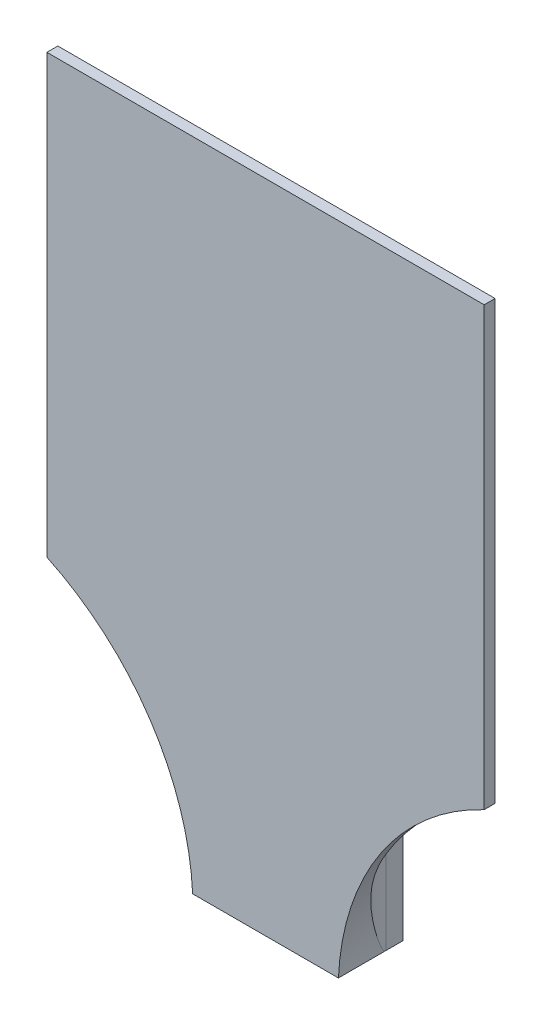
ISO-10303-21;
HEADER;
FILE_DESCRIPTION(('STEP AP214'),'2;1');
FILE_NAME('part.step','',(''),(''),'','','');
FILE_SCHEMA(('AUTOMOTIVE_DESIGN { 1 0 10303 214 1 1 1 1 }'));
ENDSEC;
DATA;
#1=APPLICATION_CONTEXT('core data for automotive mechanical design processes');
#2=APPLICATION_PROTOCOL_DEFINITION('international standard','automotive_design',2000,#1);
#3=PRODUCT_CONTEXT('',#1,'mechanical');
#4=PRODUCT('Part','Part','',(#3));
#5=PRODUCT_RELATED_PRODUCT_CATEGORY('part','',(#4));
#6=PRODUCT_DEFINITION_FORMATION('','',#4);
#7=PRODUCT_DEFINITION_CONTEXT('part definition',#1,'design');
#8=PRODUCT_DEFINITION('design','',#6,#7);
#9=PRODUCT_DEFINITION_SHAPE('','',#8);
#10=(LENGTH_UNIT() NAMED_UNIT(*) SI_UNIT(.MILLI.,.METRE.));
#11=(NAMED_UNIT(*) PLANE_ANGLE_UNIT() SI_UNIT($,.RADIAN.));
#12=(NAMED_UNIT(*) SI_UNIT($,.STERADIAN.) SOLID_ANGLE_UNIT());
#13=UNCERTAINTY_MEASURE_WITH_UNIT(LENGTH_MEASURE(1.E-05),#10,'distance_accuracy_value','');
#14=(GEOMETRIC_REPRESENTATION_CONTEXT(3) GLOBAL_UNCERTAINTY_ASSIGNED_CONTEXT((#13)) GLOBAL_UNIT_ASSIGNED_CONTEXT((#10,
#11,#12)) REPRESENTATION_CONTEXT('',''));
#15=CARTESIAN_POINT('',(0.,0.,0.));
#16=DIRECTION('',(0.,0.,1.));
#17=DIRECTION('',(1.,0.,0.));
#18=AXIS2_PLACEMENT_3D('',#15,#16,#17);
#19=CARTESIAN_POINT('',(-191.84651359388,180.,7.00000000000004));
#20=DIRECTION('',(0.,-0.099503719020999,0.995037190209989));
#21=DIRECTION('',(0.,-0.995037190209989,-0.099503719020999));
#22=AXIS2_PLACEMENT_3D('',#19,#20,#21);
#23=PLANE('',#22);
#24=DIRECTION('',(0.,-0.995037190209989,-0.099503719020999));
#25=VECTOR('',#24,1.);
#26=CARTESIAN_POINT('',(-17.,180.,7.00000000000001));
#27=LINE('',#26,#25);
#28=CARTESIAN_POINT('',(-17.,80.,-2.99999999999999));
#29=VERTEX_POINT('',#28);
#30=CARTESIAN_POINT('',(-17.,23.139494745971,-8.68605052540289));
#31=VERTEX_POINT('',#30);
#32=EDGE_CURVE('E197',#29,#31,#27,.T.);
#33=ORIENTED_EDGE('',*,*,#32,.T.);
#34=CARTESIAN_POINT('',(-7.50000000000049,359.999999999953,24.9999999999953));
#35=DIRECTION('',(0.,-0.099503719020999,0.995037190209989));
#36=DIRECTION('',(0.,-0.995037190209989,-0.099503719020999));
#37=AXIS2_PLACEMENT_3D('',#34,#35,#36);
#38=ELLIPSE('',#37,351.745646739184,34.9999999999953);
#39=CARTESIAN_POINT('',(-20.,33.0825792344509,-7.6917420765549));
#40=VERTEX_POINT('',#39);
#41=EDGE_CURVE('E416',#31,#40,#38,.F.);
#42=ORIENTED_EDGE('',*,*,#41,.T.);
#43=DIRECTION('',(0.,0.995037190209989,0.099503719020999));
#44=VECTOR('',#43,1.);
#45=CARTESIAN_POINT('',(-20.,180.,7.00000000000001));
#46=LINE('',#45,#44);
#47=CARTESIAN_POINT('',(-20.,80.,-2.99999999999999));
#48=VERTEX_POINT('',#47);
#49=EDGE_CURVE('E332',#40,#48,#46,.T.);
#50=ORIENTED_EDGE('',*,*,#49,.T.);
#51=CARTESIAN_POINT('',(-30.,80.,-2.99999999999999));
#52=DIRECTION('',(0.,-0.099503719020999,0.995037190209989));
#53=DIRECTION('',(0.,-0.995037190209989,-0.099503719020999));
#54=AXIS2_PLACEMENT_3D('',#51,#52,#53);
#55=ELLIPSE('',#54,100.498756211209,10.);
#56=CARTESIAN_POINT('',(-30.,180.,7.00000000000001));
#57=VERTEX_POINT('',#56);
#58=EDGE_CURVE('E269',#48,#57,#55,.T.);
#59=ORIENTED_EDGE('',*,*,#58,.T.);
#60=DIRECTION('',(1.,0.,0.));
#61=VECTOR('',#60,1.);
#62=CARTESIAN_POINT('',(-191.84651359388,180.,7.00000000000004));
#63=LINE('',#62,#61);
#64=CARTESIAN_POINT('',(-7.00000000000001,180.,7.00000000000001));
#65=VERTEX_POINT('',#64);
#66=EDGE_CURVE('E325',#57,#65,#63,.T.);
#67=ORIENTED_EDGE('',*,*,#66,.T.);
#68=CARTESIAN_POINT('',(-7.00000000000002,80.,-2.99999999999999));
#69=DIRECTION('',(0.,-0.099503719020999,0.995037190209989));
#70=DIRECTION('',(0.,-0.995037190209989,-0.099503719020999));
#71=AXIS2_PLACEMENT_3D('',#68,#69,#70);
#72=ELLIPSE('',#71,100.498756211209,10.);
#73=EDGE_CURVE('E449',#65,#29,#72,.T.);
#74=ORIENTED_EDGE('',*,*,#73,.T.);
#75=EDGE_LOOP('',(#33,#42,#50,#59,#67,#74));
#76=FACE_BOUND('',#75,.T.);
#77=ADVANCED_FACE('F33',(#76),#23,.F.);
#78=CARTESIAN_POINT('',(-20.,60.,-10.));
#79=DIRECTION('',(0.,0.,1.));
#80=DIRECTION('',(1.,0.,0.));
#81=AXIS2_PLACEMENT_3D('',#78,#79,#80);
#82=PLANE('',#81);
#83=DIRECTION('',(0.,-1.,0.));
#84=VECTOR('',#83,1.);
#85=CARTESIAN_POINT('',(7.49999999999951,180.,-10.));
#86=LINE('',#85,#84);
#87=CARTESIAN_POINT('',(7.49999999999951,10.,-10.));
#88=VERTEX_POINT('',#87);
#89=CARTESIAN_POINT('',(7.49999999999951,0.,-10.));
#90=VERTEX_POINT('',#89);
#91=EDGE_CURVE('E56',#88,#90,#86,.T.);
#92=ORIENTED_EDGE('',*,*,#91,.T.);
#93=DIRECTION('',(-1.,0.,0.));
#94=VECTOR('',#93,1.);
#95=CARTESIAN_POINT('',(-20.,0.,-10.));
#96=LINE('',#95,#94);
#97=CARTESIAN_POINT('',(-7.50000000000048,0.,-10.));
#98=VERTEX_POINT('',#97);
#99=EDGE_CURVE('E176',#90,#98,#96,.T.);
#100=ORIENTED_EDGE('',*,*,#99,.T.);
#101=DIRECTION('',(0.,-1.,0.));
#102=VECTOR('',#101,1.);
#103=CARTESIAN_POINT('',(-7.50000000000048,180.,-10.));
#104=LINE('',#103,#102);
#105=CARTESIAN_POINT('',(-7.50000000000048,10.0000000000001,-10.));
#106=VERTEX_POINT('',#105);
#107=EDGE_CURVE('E179',#106,#98,#104,.T.);
#108=ORIENTED_EDGE('',*,*,#107,.F.);
#109=DIRECTION('',(-1.,0.,0.));
#110=VECTOR('',#109,1.);
#111=CARTESIAN_POINT('',(17.,10.,-10.));
#112=LINE('',#111,#110);
#113=EDGE_CURVE('E178',#88,#106,#112,.T.);
#114=ORIENTED_EDGE('',*,*,#113,.F.);
#115=EDGE_LOOP('',(#92,#100,#108,#114));
#116=FACE_BOUND('',#115,.T.);
#117=ADVANCED_FACE('F174',(#116),#82,.F.);
#118=DIRECTION('',(0.,-0.995037190209989,-0.099503719020999));
#119=VECTOR('',#118,1.);
#120=CARTESIAN_POINT('',(20.,180.,7.00000000000001));
#121=LINE('',#120,#119);
#122=CARTESIAN_POINT('',(20.,80.,-2.99999999999999));
#123=VERTEX_POINT('',#122);
#124=CARTESIAN_POINT('',(20.,33.0825792344598,-7.69174207655402));
#125=VERTEX_POINT('',#124);
#126=EDGE_CURVE('E316',#123,#125,#121,.T.);
#127=ORIENTED_EDGE('',*,*,#126,.T.);
#128=CARTESIAN_POINT('',(7.49999999999951,360.000000000018,25.0000000000018));
#129=DIRECTION('',(0.,-0.099503719020999,0.995037190209989));
#130=DIRECTION('',(0.,-0.995037190209989,-0.099503719020999));
#131=AXIS2_PLACEMENT_3D('',#128,#129,#130);
#132=ELLIPSE('',#131,351.74564673924,35.0000000000009);
#133=CARTESIAN_POINT('',(17.,23.1394947459807,-8.68605052540193));
#134=VERTEX_POINT('',#133);
#135=EDGE_CURVE('E317',#125,#134,#132,.F.);
#136=ORIENTED_EDGE('',*,*,#135,.T.);
#137=DIRECTION('',(0.,0.995037190209989,0.099503719020999));
#138=VECTOR('',#137,1.);
#139=CARTESIAN_POINT('',(17.,180.,7.));
#140=LINE('',#139,#138);
#141=CARTESIAN_POINT('',(17.,80.,-2.99999999999999));
#142=VERTEX_POINT('',#141);
#143=EDGE_CURVE('E195',#134,#142,#140,.T.);
#144=ORIENTED_EDGE('',*,*,#143,.T.);
#145=CARTESIAN_POINT('',(6.99999999999999,80.,-2.99999999999999));
#146=DIRECTION('',(0.,-0.099503719020999,0.995037190209989));
#147=DIRECTION('',(0.,0.995037190209989,0.099503719020999));
#148=AXIS2_PLACEMENT_3D('',#145,#146,#147);
#149=ELLIPSE('',#148,100.498756211209,10.);
#150=CARTESIAN_POINT('',(7.,180.,7.00000000000001));
#151=VERTEX_POINT('',#150);
#152=EDGE_CURVE('E226',#142,#151,#149,.T.);
#153=ORIENTED_EDGE('',*,*,#152,.T.);
#154=CARTESIAN_POINT('',(30.,180.,7.00000000000001));
#155=VERTEX_POINT('',#154);
#156=EDGE_CURVE('E322',#151,#155,#63,.T.);
#157=ORIENTED_EDGE('',*,*,#156,.T.);
#158=CARTESIAN_POINT('',(30.,80.,-3.));
#159=DIRECTION('',(0.,-0.099503719020999,0.995037190209989));
#160=DIRECTION('',(0.,0.995037190209989,0.099503719020999));
#161=AXIS2_PLACEMENT_3D('',#158,#159,#160);
#162=ELLIPSE('',#161,100.498756211209,10.);
#163=EDGE_CURVE('E237',#155,#123,#162,.T.);
#164=ORIENTED_EDGE('',*,*,#163,.T.);
#165=EDGE_LOOP('',(#127,#136,#144,#153,#157,#164));
#166=FACE_BOUND('',#165,.T.);
#167=ADVANCED_FACE('F299',(#166),#23,.F.);
#168=CARTESIAN_POINT('',(10.,15.6568542494924,0.));
#169=DIRECTION('',(0.,-1.,0.));
#170=DIRECTION('',(0.,0.,-1.));
#171=AXIS2_PLACEMENT_3D('',#168,#169,#170);
#172=CYLINDRICAL_SURFACE('',#171,2.);
#173=CARTESIAN_POINT('',(10.,10.,0.));
#174=DIRECTION('',(0.,-1.,0.));
#175=DIRECTION('',(0.,0.,-1.));
#176=AXIS2_PLACEMENT_3D('',#173,#174,#175);
#177=CIRCLE('',#176,2.);
#178=CARTESIAN_POINT('',(10.,10.,-2.));
#179=VERTEX_POINT('',#178);
#180=EDGE_CURVE('E428',#179,#179,#177,.F.);
#181=ORIENTED_EDGE('',*,*,#180,.T.);
#182=EDGE_LOOP('',(#181));
#183=FACE_BOUND('',#182,.T.);
#184=CARTESIAN_POINT('',(10.,6.,0.));
#185=DIRECTION('',(0.,-1.,0.));
#186=DIRECTION('',(0.,0.,-1.));
#187=AXIS2_PLACEMENT_3D('',#184,#185,#186);
#188=CIRCLE('',#187,2.);
#189=CARTESIAN_POINT('',(10.,6.,-2.));
#190=VERTEX_POINT('',#189);
#191=EDGE_CURVE('E431',#190,#190,#188,.F.);
#192=ORIENTED_EDGE('',*,*,#191,.F.);
#193=EDGE_LOOP('',(#192));
#194=FACE_BOUND('',#193,.T.);
#195=ADVANCED_FACE('F305',(#183,#194),#172,.F.);
#196=CARTESIAN_POINT('',(-10.,15.6568542494924,0.));
#197=DIRECTION('',(0.,-1.,0.));
#198=DIRECTION('',(0.,0.,-1.));
#199=AXIS2_PLACEMENT_3D('',#196,#197,#198);
#200=CYLINDRICAL_SURFACE('',#199,2.);
#201=CARTESIAN_POINT('',(-10.,10.,0.));
#202=DIRECTION('',(0.,-1.,0.));
#203=DIRECTION('',(0.,0.,-1.));
#204=AXIS2_PLACEMENT_3D('',#201,#202,#203);
#205=CIRCLE('',#204,2.);
#206=CARTESIAN_POINT('',(-10.,10.,-2.));
#207=VERTEX_POINT('',#206);
#208=EDGE_CURVE('E425',#207,#207,#205,.F.);
#209=ORIENTED_EDGE('',*,*,#208,.T.);
#210=EDGE_LOOP('',(#209));
#211=FACE_BOUND('',#210,.T.);
#212=CARTESIAN_POINT('',(-10.,6.,0.));
#213=DIRECTION('',(0.,-1.,0.));
#214=DIRECTION('',(0.,0.,-1.));
#215=AXIS2_PLACEMENT_3D('',#212,#213,#214);
#216=CIRCLE('',#215,2.);
#217=CARTESIAN_POINT('',(-10.,6.,-2.));
#218=VERTEX_POINT('',#217);
#219=EDGE_CURVE('E270',#218,#218,#216,.F.);
#220=ORIENTED_EDGE('',*,*,#219,.F.);
#221=EDGE_LOOP('',(#220));
#222=FACE_BOUND('',#221,.T.);
#223=ADVANCED_FACE('F310',(#211,#222),#200,.F.);
#224=CARTESIAN_POINT('',(60.,180.,7.));
#225=DIRECTION('',(0.,0.,1.));
#226=DIRECTION('',(1.,0.,0.));
#227=AXIS2_PLACEMENT_3D('',#224,#225,#226);
#228=PLANE('',#227);
#229=DIRECTION('',(-1.,0.,0.));
#230=VECTOR('',#229,1.);
#231=CARTESIAN_POINT('',(60.,180.,7.));
#232=LINE('',#231,#230);
#233=CARTESIAN_POINT('',(-60.,180.,7.00000000000002));
#234=VERTEX_POINT('',#233);
#235=EDGE_CURVE('E353',#57,#234,#232,.T.);
#236=ORIENTED_EDGE('',*,*,#235,.F.);
#237=DIRECTION('',(0.,1.,0.));
#238=VECTOR('',#237,1.);
#239=CARTESIAN_POINT('',(-30.,0.,7.00000000000001));
#240=LINE('',#239,#238);
#241=CARTESIAN_POINT('',(-30.,32.9012986677228,7.));
#242=VERTEX_POINT('',#241);
#243=EDGE_CURVE('E224',#57,#242,#240,.F.);
#244=ORIENTED_EDGE('',*,*,#243,.T.);
#245=CARTESIAN_POINT('',(-89.9230176602706,-3.28201177351375,7.));
#246=DIRECTION('',(0.,0.,-1.));
#247=DIRECTION('',(-1.,0.,0.));
#248=AXIS2_PLACEMENT_3D('',#245,#246,#247);
#249=CIRCLE('',#248,70.);
#250=CARTESIAN_POINT('',(-60.,60.,7.));
#251=VERTEX_POINT('',#250);
#252=EDGE_CURVE('E340',#251,#242,#249,.T.);
#253=ORIENTED_EDGE('',*,*,#252,.F.);
#254=DIRECTION('',(0.,-1.,0.));
#255=VECTOR('',#254,1.);
#256=CARTESIAN_POINT('',(-60.,180.,7.00000000000002));
#257=LINE('',#256,#255);
#258=EDGE_CURVE('E366',#234,#251,#257,.T.);
#259=ORIENTED_EDGE('',*,*,#258,.F.);
#260=EDGE_LOOP('',(#236,#244,#253,#259));
#261=FACE_BOUND('',#260,.T.);
#262=ADVANCED_FACE('F403',(#261),#228,.F.);
#263=CARTESIAN_POINT('',(89.9230176602706,-3.28201177351375,7.));
#264=DIRECTION('',(0.,0.,-1.));
#265=DIRECTION('',(-1.,0.,0.));
#266=AXIS2_PLACEMENT_3D('',#263,#264,#265);
#267=CIRCLE('',#266,70.);
#268=CARTESIAN_POINT('',(30.,32.9012986677227,7.));
#269=VERTEX_POINT('',#268);
#270=CARTESIAN_POINT('',(60.,60.,7.));
#271=VERTEX_POINT('',#270);
#272=EDGE_CURVE('E335',#269,#271,#267,.T.);
#273=ORIENTED_EDGE('',*,*,#272,.F.);
#274=DIRECTION('',(0.,-1.,0.));
#275=VECTOR('',#274,1.);
#276=CARTESIAN_POINT('',(30.,180.,7.));
#277=LINE('',#276,#275);
#278=EDGE_CURVE('E216',#269,#155,#277,.F.);
#279=ORIENTED_EDGE('',*,*,#278,.T.);
#280=CARTESIAN_POINT('',(60.,180.,7.));
#281=VERTEX_POINT('',#280);
#282=EDGE_CURVE('E354',#281,#155,#232,.T.);
#283=ORIENTED_EDGE('',*,*,#282,.F.);
#284=DIRECTION('',(0.,-1.,0.));
#285=VECTOR('',#284,1.);
#286=CARTESIAN_POINT('',(60.,180.,7.));
#287=LINE('',#286,#285);
#288=EDGE_CURVE('E369',#281,#271,#287,.T.);
#289=ORIENTED_EDGE('',*,*,#288,.T.);
#290=EDGE_LOOP('',(#273,#279,#283,#289));
#291=FACE_BOUND('',#290,.T.);
#292=ADVANCED_FACE('F386',(#291),#228,.F.);
#293=CARTESIAN_POINT('',(20.,60.,-10.));
#294=DIRECTION('',(-1.,0.,0.));
#295=DIRECTION('',(0.,0.,1.));
#296=AXIS2_PLACEMENT_3D('',#293,#294,#295);
#297=PLANE('',#296);
#298=DIRECTION('',(0.,0.,-1.));
#299=VECTOR('',#298,1.);
#300=CARTESIAN_POINT('',(20.,0.,-10.));
#301=LINE('',#300,#299);
#302=CARTESIAN_POINT('',(20.,0.,-2.99999999999999));
#303=VERTEX_POINT('',#302);
#304=CARTESIAN_POINT('',(20.,0.,-7.69174207655401));
#305=VERTEX_POINT('',#304);
#306=EDGE_CURVE('E189',#303,#305,#301,.T.);
#307=ORIENTED_EDGE('',*,*,#306,.T.);
#308=DIRECTION('',(0.,-1.,0.));
#309=VECTOR('',#308,1.);
#310=CARTESIAN_POINT('',(20.,180.,-7.69174207655401));
#311=LINE('',#310,#309);
#312=EDGE_CURVE('E164',#305,#125,#311,.F.);
#313=ORIENTED_EDGE('',*,*,#312,.T.);
#314=ORIENTED_EDGE('',*,*,#126,.F.);
#315=DIRECTION('',(0.,-1.,0.));
#316=VECTOR('',#315,1.);
#317=CARTESIAN_POINT('',(20.,0.,-2.99999999999999));
#318=LINE('',#317,#316);
#319=EDGE_CURVE('E213',#123,#303,#318,.T.);
#320=ORIENTED_EDGE('',*,*,#319,.T.);
#321=EDGE_LOOP('',(#307,#313,#314,#320));
#322=FACE_BOUND('',#321,.T.);
#323=ADVANCED_FACE('F376',(#322),#297,.F.);
#324=CARTESIAN_POINT('',(-20.,60.,-10.));
#325=DIRECTION('',(1.,0.,0.));
#326=DIRECTION('',(0.,0.,-1.));
#327=AXIS2_PLACEMENT_3D('',#324,#325,#326);
#328=PLANE('',#327);
#329=ORIENTED_EDGE('',*,*,#49,.F.);
#330=DIRECTION('',(0.,-1.,0.));
#331=VECTOR('',#330,1.);
#332=CARTESIAN_POINT('',(-20.,180.,-7.6917420765549));
#333=LINE('',#332,#331);
#334=CARTESIAN_POINT('',(-20.,0.,-7.69174207655491));
#335=VERTEX_POINT('',#334);
#336=EDGE_CURVE('E413',#40,#335,#333,.T.);
#337=ORIENTED_EDGE('',*,*,#336,.T.);
#338=DIRECTION('',(0.,0.,1.));
#339=VECTOR('',#338,1.);
#340=CARTESIAN_POINT('',(-20.,0.,-10.));
#341=LINE('',#340,#339);
#342=CARTESIAN_POINT('',(-20.,0.,-2.99999999999999));
#343=VERTEX_POINT('',#342);
#344=EDGE_CURVE('E184',#335,#343,#341,.T.);
#345=ORIENTED_EDGE('',*,*,#344,.T.);
#346=DIRECTION('',(0.,1.,0.));
#347=VECTOR('',#346,1.);
#348=CARTESIAN_POINT('',(-20.,180.,-2.99999999999999));
#349=LINE('',#348,#347);
#350=EDGE_CURVE('E221',#343,#48,#349,.T.);
#351=ORIENTED_EDGE('',*,*,#350,.T.);
#352=EDGE_LOOP('',(#329,#337,#345,#351));
#353=FACE_BOUND('',#352,.T.);
#354=ADVANCED_FACE('F411',(#353),#328,.F.);
#355=CARTESIAN_POINT('',(-20.,60.,10.));
#356=DIRECTION('',(0.,0.,-1.));
#357=DIRECTION('',(-1.,0.,0.));
#358=AXIS2_PLACEMENT_3D('',#355,#356,#357);
#359=PLANE('',#358);
#360=DIRECTION('',(1.,0.,0.));
#361=VECTOR('',#360,1.);
#362=CARTESIAN_POINT('',(-20.,0.,10.));
#363=LINE('',#362,#361);
#364=CARTESIAN_POINT('',(-20.,0.,10.));
#365=VERTEX_POINT('',#364);
#366=CARTESIAN_POINT('',(20.,0.,10.));
#367=VERTEX_POINT('',#366);
#368=EDGE_CURVE('E187',#365,#367,#363,.T.);
#369=ORIENTED_EDGE('',*,*,#368,.T.);
#370=CARTESIAN_POINT('',(89.9230176602706,-3.28201177351375,10.));
#371=DIRECTION('',(0.,0.,-1.));
#372=DIRECTION('',(-1.,0.,0.));
#373=AXIS2_PLACEMENT_3D('',#370,#371,#372);
#374=CIRCLE('',#373,70.);
#375=CARTESIAN_POINT('',(60.,60.,10.));
#376=VERTEX_POINT('',#375);
#377=EDGE_CURVE('E334',#367,#376,#374,.T.);
#378=ORIENTED_EDGE('',*,*,#377,.T.);
#379=DIRECTION('',(0.,-1.,0.));
#380=VECTOR('',#379,1.);
#381=CARTESIAN_POINT('',(60.,180.,10.));
#382=LINE('',#381,#380);
#383=CARTESIAN_POINT('',(60.,180.,10.));
#384=VERTEX_POINT('',#383);
#385=EDGE_CURVE('E371',#384,#376,#382,.T.);
#386=ORIENTED_EDGE('',*,*,#385,.F.);
#387=DIRECTION('',(1.,0.,0.));
#388=VECTOR('',#387,1.);
#389=CARTESIAN_POINT('',(-60.,180.,10.));
#390=LINE('',#389,#388);
#391=CARTESIAN_POINT('',(-60.,180.,10.));
#392=VERTEX_POINT('',#391);
#393=EDGE_CURVE('E348',#392,#384,#390,.T.);
#394=ORIENTED_EDGE('',*,*,#393,.F.);
#395=DIRECTION('',(0.,-1.,0.));
#396=VECTOR('',#395,1.);
#397=CARTESIAN_POINT('',(-60.,180.,10.));
#398=LINE('',#397,#396);
#399=CARTESIAN_POINT('',(-60.,60.,10.));
#400=VERTEX_POINT('',#399);
#401=EDGE_CURVE('E359',#392,#400,#398,.T.);
#402=ORIENTED_EDGE('',*,*,#401,.T.);
#403=CARTESIAN_POINT('',(-89.9230176602706,-3.28201177351375,10.));
#404=DIRECTION('',(0.,0.,-1.));
#405=DIRECTION('',(-1.,0.,0.));
#406=AXIS2_PLACEMENT_3D('',#403,#404,#405);
#407=CIRCLE('',#406,70.);
#408=EDGE_CURVE('E337',#400,#365,#407,.T.);
#409=ORIENTED_EDGE('',*,*,#408,.T.);
#410=EDGE_LOOP('',(#369,#378,#386,#394,#402,#409));
#411=FACE_BOUND('',#410,.T.);
#412=ADVANCED_FACE('F394',(#411),#359,.F.);
#413=CARTESIAN_POINT('',(0.,0.,0.));
#414=DIRECTION('',(0.,1.,0.));
#415=DIRECTION('',(0.,0.,1.));
#416=AXIS2_PLACEMENT_3D('',#413,#414,#415);
#417=PLANE('',#416);
#418=CARTESIAN_POINT('',(10.,0.,0.));
#419=DIRECTION('',(0.,1.,0.));
#420=DIRECTION('',(0.,0.,1.));
#421=AXIS2_PLACEMENT_3D('',#418,#419,#420);
#422=CIRCLE('',#421,7.5);
#423=CARTESIAN_POINT('',(10.,0.,7.5));
#424=VERTEX_POINT('',#423);
#425=EDGE_CURVE('E730',#424,#424,#422,.T.);
#426=ORIENTED_EDGE('',*,*,#425,.T.);
#427=EDGE_LOOP('',(#426));
#428=FACE_BOUND('',#427,.T.);
#429=CARTESIAN_POINT('',(-10.,0.,0.));
#430=DIRECTION('',(0.,1.,0.));
#431=DIRECTION('',(0.,0.,1.));
#432=AXIS2_PLACEMENT_3D('',#429,#430,#431);
#433=CIRCLE('',#432,7.5);
#434=CARTESIAN_POINT('',(-10.,0.,7.5));
#435=VERTEX_POINT('',#434);
#436=EDGE_CURVE('E732',#435,#435,#433,.T.);
#437=ORIENTED_EDGE('',*,*,#436,.T.);
#438=EDGE_LOOP('',(#437));
#439=FACE_BOUND('',#438,.T.);
#440=ORIENTED_EDGE('',*,*,#99,.F.);
#441=CARTESIAN_POINT('',(7.49999999999951,0.,25.0000000000018));
#442=DIRECTION('',(0.,1.,0.));
#443=DIRECTION('',(0.,0.,1.));
#444=AXIS2_PLACEMENT_3D('',#441,#442,#443);
#445=CIRCLE('',#444,35.0000000000009);
#446=EDGE_CURVE('E161',#305,#90,#445,.T.);
#447=ORIENTED_EDGE('',*,*,#446,.F.);
#448=ORIENTED_EDGE('',*,*,#306,.F.);
#449=EDGE_CURVE('E185',#367,#303,#301,.T.);
#450=ORIENTED_EDGE('',*,*,#449,.F.);
#451=ORIENTED_EDGE('',*,*,#368,.F.);
#452=DIRECTION('',(0.,0.,1.));
#453=VECTOR('',#452,1.);
#454=CARTESIAN_POINT('',(-20.,0.,7.));
#455=LINE('',#454,#453);
#456=EDGE_CURVE('E343',#343,#365,#455,.T.);
#457=ORIENTED_EDGE('',*,*,#456,.F.);
#458=ORIENTED_EDGE('',*,*,#344,.F.);
#459=CARTESIAN_POINT('',(-7.50000000000049,0.,24.9999999999953));
#460=DIRECTION('',(0.,1.,0.));
#461=DIRECTION('',(0.,0.,1.));
#462=AXIS2_PLACEMENT_3D('',#459,#460,#461);
#463=CIRCLE('',#462,34.9999999999953);
#464=EDGE_CURVE('E169',#98,#335,#463,.T.);
#465=ORIENTED_EDGE('',*,*,#464,.F.);
#466=EDGE_LOOP('',(#440,#447,#448,#450,#451,#457,#458,#465));
#467=FACE_BOUND('',#466,.T.);
#468=ADVANCED_FACE('F182',(#428,#439,#467),#417,.F.);
#469=CARTESIAN_POINT('',(60.,180.,10.));
#470=DIRECTION('',(-1.,0.,0.));
#471=DIRECTION('',(0.,0.,1.));
#472=AXIS2_PLACEMENT_3D('',#469,#470,#471);
#473=PLANE('',#472);
#474=DIRECTION('',(0.,0.,-1.));
#475=VECTOR('',#474,1.);
#476=CARTESIAN_POINT('',(60.,60.,10.));
#477=LINE('',#476,#475);
#478=EDGE_CURVE('E347',#376,#271,#477,.T.);
#479=ORIENTED_EDGE('',*,*,#478,.T.);
#480=ORIENTED_EDGE('',*,*,#288,.F.);
#481=DIRECTION('',(0.,0.,-1.));
#482=VECTOR('',#481,1.);
#483=CARTESIAN_POINT('',(60.,180.,10.));
#484=LINE('',#483,#482);
#485=EDGE_CURVE('E350',#384,#281,#484,.T.);
#486=ORIENTED_EDGE('',*,*,#485,.F.);
#487=ORIENTED_EDGE('',*,*,#385,.T.);
#488=EDGE_LOOP('',(#479,#480,#486,#487));
#489=FACE_BOUND('',#488,.T.);
#490=ADVANCED_FACE('F392',(#489),#473,.F.);
#491=CARTESIAN_POINT('',(-60.,180.,7.00000000000002));
#492=DIRECTION('',(1.,0.,0.));
#493=DIRECTION('',(0.,0.,-1.));
#494=AXIS2_PLACEMENT_3D('',#491,#492,#493);
#495=PLANE('',#494);
#496=DIRECTION('',(0.,0.,1.));
#497=VECTOR('',#496,1.);
#498=CARTESIAN_POINT('',(-60.,60.,7.00000000000002));
#499=LINE('',#498,#497);
#500=EDGE_CURVE('E351',#251,#400,#499,.T.);
#501=ORIENTED_EDGE('',*,*,#500,.T.);
#502=ORIENTED_EDGE('',*,*,#401,.F.);
#503=DIRECTION('',(0.,0.,1.));
#504=VECTOR('',#503,1.);
#505=CARTESIAN_POINT('',(-60.,180.,7.00000000000002));
#506=LINE('',#505,#504);
#507=EDGE_CURVE('E357',#234,#392,#506,.T.);
#508=ORIENTED_EDGE('',*,*,#507,.F.);
#509=ORIENTED_EDGE('',*,*,#258,.T.);
#510=EDGE_LOOP('',(#501,#502,#508,#509));
#511=FACE_BOUND('',#510,.T.);
#512=ADVANCED_FACE('F398',(#511),#495,.F.);
#513=CARTESIAN_POINT('',(0.,180.,0.));
#514=DIRECTION('',(0.,1.,0.));
#515=DIRECTION('',(0.,0.,1.));
#516=AXIS2_PLACEMENT_3D('',#513,#514,#515);
#517=PLANE('',#516);
#518=ORIENTED_EDGE('',*,*,#66,.F.);
#519=ORIENTED_EDGE('',*,*,#235,.T.);
#520=ORIENTED_EDGE('',*,*,#507,.T.);
#521=ORIENTED_EDGE('',*,*,#393,.T.);
#522=ORIENTED_EDGE('',*,*,#485,.T.);
#523=ORIENTED_EDGE('',*,*,#282,.T.);
#524=ORIENTED_EDGE('',*,*,#156,.F.);
#525=DIRECTION('',(1.,0.,0.));
#526=VECTOR('',#525,1.);
#527=CARTESIAN_POINT('',(17.,180.,7.00000000000001));
#528=LINE('',#527,#526);
#529=EDGE_CURVE('E328',#65,#151,#528,.T.);
#530=ORIENTED_EDGE('',*,*,#529,.F.);
#531=EDGE_LOOP('',(#518,#519,#520,#521,#522,#523,#524,#530));
#532=FACE_BOUND('',#531,.T.);
#533=ADVANCED_FACE('F255',(#532),#517,.T.);
#534=CARTESIAN_POINT('',(-89.9230176602706,-3.28201177351375,7.));
#535=DIRECTION('',(0.,0.,1.));
#536=DIRECTION('',(1.,0.,0.));
#537=AXIS2_PLACEMENT_3D('',#534,#535,#536);
#538=CYLINDRICAL_SURFACE('',#537,70.);
#539=ORIENTED_EDGE('',*,*,#408,.F.);
#540=ORIENTED_EDGE('',*,*,#500,.F.);
#541=ORIENTED_EDGE('',*,*,#252,.T.);
#542=CARTESIAN_POINT('',(-30.,32.9012986677228,7.00000000000001));
#543=CARTESIAN_POINT('',(-29.8483223664483,32.6501074625996,6.99999536558056));
#544=CARTESIAN_POINT('',(-29.6982356945758,32.397978460594,6.99654961709316));
#545=CARTESIAN_POINT('',(-29.4013276742711,31.8919993700122,6.98317044778221));
#546=CARTESIAN_POINT('',(-29.2545060854425,31.6381494099516,6.97323750623355));
#547=CARTESIAN_POINT('',(-28.819165966007,30.8744311282963,6.93431092087225));
#548=CARTESIAN_POINT('',(-28.5356306793899,30.3621601964792,6.89618877497577));
#549=CARTESIAN_POINT('',(-27.9828278235974,29.3332216043956,6.79845184288116));
#550=CARTESIAN_POINT('',(-27.713536359057,28.8165631118919,6.73887445202172));
#551=CARTESIAN_POINT('',(-27.1888905920775,27.7786939547544,6.60058647699747));
#552=CARTESIAN_POINT('',(-26.9335378808966,27.257482778229,6.52187371389539));
#553=CARTESIAN_POINT('',(-26.4384720525034,26.2144905021616,6.34793684134942));
#554=CARTESIAN_POINT('',(-26.1986715787799,25.6927330882782,6.25281841800563));
#555=CARTESIAN_POINT('',(-25.7330160479516,24.64596433714,6.0475186130052));
#556=CARTESIAN_POINT('',(-25.5071614393263,24.120952895837,5.9373367472951));
#557=CARTESIAN_POINT('',(-25.0693203157562,23.0680004143892,5.70344849292746));
#558=CARTESIAN_POINT('',(-24.8573377128822,22.5400585929904,5.57973831517371));
#559=CARTESIAN_POINT('',(-24.4472535712919,21.4817991797746,5.3202093889657));
#560=CARTESIAN_POINT('',(-24.2491515691135,20.9514816679098,5.18439104513797));
#561=CARTESIAN_POINT('',(-23.8555297353455,19.857659513149,4.8935935073626));
#562=CARTESIAN_POINT('',(-23.6608409492749,19.2940305828376,4.73795795081205));
#563=CARTESIAN_POINT('',(-23.286833726026,18.164959599686,4.41581397807999));
#564=CARTESIAN_POINT('',(-23.1075115364507,17.5995180246666,4.24930823390676));
#565=CARTESIAN_POINT('',(-22.7639833982978,16.4667738155578,3.90644482382332));
#566=CARTESIAN_POINT('',(-22.5997834344525,15.8994705358863,3.73008330140523));
#567=CARTESIAN_POINT('',(-22.2864409454413,14.7635045990547,3.36853443160352));
#568=CARTESIAN_POINT('',(-22.13729903776,14.1948418871266,3.18334672274302));
#569=CARTESIAN_POINT('',(-21.7992772689365,12.8368213535676,2.731969199096));
#570=CARTESIAN_POINT('',(-21.6172682619899,12.0469694008056,2.4620950679861));
#571=CARTESIAN_POINT('',(-21.2816446269611,10.4662431276874,1.90867248643159));
#572=CARTESIAN_POINT('',(-21.1280235707773,9.67536907971658,1.62512715004402));
#573=CARTESIAN_POINT('',(-20.8943355759471,8.35131163234666,1.13931743508179));
#574=CARTESIAN_POINT('',(-20.80661239309,7.81813483295962,0.94067459752522));
#575=CARTESIAN_POINT('',(-20.643845642903,6.75227296025878,0.536924811810843));
#576=CARTESIAN_POINT('',(-20.5688021474731,6.21958788975036,0.331817827005948));
#577=CARTESIAN_POINT('',(-20.454562378719,5.33540762385866,-0.0157372351338176));
#578=CARTESIAN_POINT('',(-20.4118197029732,4.98348650928279,-0.155948693880741));
#579=CARTESIAN_POINT('',(-20.3318685731012,4.28085204254451,-0.440861620270657));
#580=CARTESIAN_POINT('',(-20.2946596945608,3.93013859977721,-0.58556274254935));
#581=CARTESIAN_POINT('',(-20.237585810831,3.35078015763735,-0.830849273515966));
#582=CARTESIAN_POINT('',(-20.216147245394,3.12149489774788,-0.929557260590508));
#583=CARTESIAN_POINT('',(-20.1756707614308,2.6644318956891,-1.13100128609497));
#584=CARTESIAN_POINT('',(-20.1566331625785,2.43665435808107,-1.23373785852399));
#585=CARTESIAN_POINT('',(-20.1270841701107,2.06121167688378,-1.4092447250342));
#586=CARTESIAN_POINT('',(-20.1158828642007,1.91277868827693,-1.48025295892615));
#587=CARTESIAN_POINT('',(-20.0945573387241,1.6177792908811,-1.62607756954351));
#588=CARTESIAN_POINT('',(-20.0844326032821,1.47121201798095,-1.70089209671163));
#589=CARTESIAN_POINT('',(-20.0685122239857,1.22990545647164,-1.83028073437172));
#590=CARTESIAN_POINT('',(-20.0624053754914,1.1343050082184,-1.88320538401562));
#591=CARTESIAN_POINT('',(-20.0507080567921,0.945197379865384,-1.99270831110728));
#592=CARTESIAN_POINT('',(-20.0451173827548,0.851689384623542,-2.04928513122169));
#593=CARTESIAN_POINT('',(-20.0349023553845,0.675080217693966,-2.16342453722576));
#594=CARTESIAN_POINT('',(-20.0302369248803,0.591725993409599,-2.22059111207324));
#595=CARTESIAN_POINT('',(-20.0214799978453,0.430326138453544,-2.34204951030172));
#596=CARTESIAN_POINT('',(-20.0173870991935,0.352267788846959,-2.4063232111141));
#597=CARTESIAN_POINT('',(-20.0121077752997,0.248666797067955,-2.50713319224089));
#598=CARTESIAN_POINT('',(-20.010588333986,0.218424644376737,-2.53875589000928));
#599=CARTESIAN_POINT('',(-20.0077491856942,0.161248787659366,-2.60499381789701));
#600=CARTESIAN_POINT('',(-20.0064296214749,0.134317450886772,-2.63961115942059));
#601=CARTESIAN_POINT('',(-20.0042878569582,0.0901715475221407,-2.70569006899625));
#602=CARTESIAN_POINT('',(-20.0034188095173,0.0720810259438541,-2.73655380195075));
#603=CARTESIAN_POINT('',(-20.0019358061503,0.0410220593552745,-2.8006762132636));
#604=CARTESIAN_POINT('',(-20.0013205094686,0.0280267111794378,-2.83392118539524));
#605=CARTESIAN_POINT('',(-20.0005879640604,0.0125084785606669,-2.88948713184875));
#606=CARTESIAN_POINT('',(-20.0003704450839,0.00788532859494085,-2.91121850115008));
#607=CARTESIAN_POINT('',(-20.0000751028104,0.00160016498087265,-2.95528286873946));
#608=CARTESIAN_POINT('',(-19.9999984428038,-3.71895043627033E-05,-2.9776193445662));
#609=CARTESIAN_POINT('',(-20.,0.,-2.99999999999997));
#610=B_SPLINE_CURVE_WITH_KNOTS('',3,(#542,#543,#544,#545,#546,#547,#548,#549,#550,#551,#552,
#553,#554,#555,#556,#557,#558,#559,#560,#561,#562,#563,#564,#565,#566,#567,#568,#569,#570,#571,
#572,#573,#574,#575,#576,#577,#578,#579,#580,#581,#582,#583,#584,#585,#586,#587,#588,#589,#590,
#591,#592,#593,#594,#595,#596,#597,#598,#599,#600,#601,#602,#603,#604,#605,#606,#607,#608,#609),
.UNSPECIFIED.,.F.,.F.,(4,2,2,2,2,2,2,2,2,2,2,2,2,2,2,2,2,2,2,2,2,2,2,2,2,2,2,2,2,2,2,2,2,4),(0.,
0.88024023421329,1.76041544348846,3.51994602213448,5.2764245596003,7.03310320034421,
8.77886130058356,10.5246755127611,12.2709799622599,14.0172260762152,15.8657653840482,
17.7138519997068,19.5626668942714,21.4115575723077,23.9738295459703,26.5355206118571,
28.2624697622598,29.989428704991,31.1330601074189,32.2766037538324,33.0282196731846,
33.7799355601403,34.2746756830086,34.7691776556646,35.0974614596551,35.4256150680699,
35.7290246522334,36.0316776712582,36.1628779525181,36.2941715038097,36.4012183076941,
36.5076920234316,36.574154424041,36.6411632822159),.UNSPECIFIED.);
#611=EDGE_CURVE('E259',#242,#343,#610,.T.);
#612=ORIENTED_EDGE('',*,*,#611,.T.);
#613=ORIENTED_EDGE('',*,*,#456,.T.);
#614=EDGE_LOOP('',(#539,#540,#541,#612,#613));
#615=FACE_BOUND('',#614,.T.);
#616=ADVANCED_FACE('F249',(#615),#538,.F.);
#617=CARTESIAN_POINT('',(89.9230176602706,-3.28201177351375,7.));
#618=DIRECTION('',(0.,0.,1.));
#619=DIRECTION('',(1.,0.,0.));
#620=AXIS2_PLACEMENT_3D('',#617,#618,#619);
#621=CYLINDRICAL_SURFACE('',#620,70.);
#622=ORIENTED_EDGE('',*,*,#377,.F.);
#623=ORIENTED_EDGE('',*,*,#449,.T.);
#624=CARTESIAN_POINT('',(20.,0.,-2.99999999999999));
#625=CARTESIAN_POINT('',(19.9999949205248,-0.000121232031003535,-2.96842567406485));
#626=CARTESIAN_POINT('',(20.0001492587365,0.00318097832509163,-2.93704222724972));
#627=CARTESIAN_POINT('',(20.0007249803188,0.0154181584994684,-2.87595474035949));
#628=CARTESIAN_POINT('',(20.0011415068944,0.0242506692260911,-2.84623063924713));
#629=CARTESIAN_POINT('',(20.0023762422082,0.0502711880624733,-2.7785238419149));
#630=CARTESIAN_POINT('',(20.0032838463168,0.0692983039403565,-2.74127277403191));
#631=CARTESIAN_POINT('',(20.005385944184,0.112877236038467,-2.66990088714997));
#632=CARTESIAN_POINT('',(20.0065827693886,0.137473841517497,-2.63580879189026));
#633=CARTESIAN_POINT('',(20.0113545328821,0.234263019009536,-2.51545333495326));
#634=CARTESIAN_POINT('',(20.015543131529,0.316917504800799,-2.43790228333897));
#635=CARTESIAN_POINT('',(20.0247188525413,0.491015641216595,-2.29369057594798));
#636=CARTESIAN_POINT('',(20.0297109335979,0.582512361447344,-2.22710310962884));
#637=CARTESIAN_POINT('',(20.0409032277665,0.780110940713298,-2.0937224794524));
#638=CARTESIAN_POINT('',(20.0471756819694,0.886723314331081,-2.02768273836592));
#639=CARTESIAN_POINT('',(20.0604073188685,1.10290402197445,-1.90066433125041));
#640=CARTESIAN_POINT('',(20.067367115772,1.2124749350512,-1.83969028313244));
#641=CARTESIAN_POINT('',(20.0892435263322,1.5442762674508,-1.66158948871201));
#642=CARTESIAN_POINT('',(20.1051330605427,1.76916515670936,-1.54954975647428));
#643=CARTESIAN_POINT('',(20.1393694088849,2.22200080101516,-1.33270787857452));
#644=CARTESIAN_POINT('',(20.1577152017595,2.4499462499589,-1.22790275222664));
#645=CARTESIAN_POINT('',(20.1968111888246,2.90739491283044,-1.02304847380344));
#646=CARTESIAN_POINT('',(20.217558162708,3.13689566053477,-0.922993199922007));
#647=CARTESIAN_POINT('',(20.2831956851073,3.82478933437653,-0.628467817723262));
#648=CARTESIAN_POINT('',(20.3316511873381,4.28481087367251,-0.438610030930373));
#649=CARTESIAN_POINT('',(20.4380804840337,5.20674913566487,-0.06623028402384));
#650=CARTESIAN_POINT('',(20.4960553938872,5.66866607425393,0.116290813326775));
#651=CARTESIAN_POINT('',(20.6215951297146,6.59376123275112,0.475892306657822));
#652=CARTESIAN_POINT('',(20.6891678529923,7.05694018013952,0.652968074660575));
#653=CARTESIAN_POINT('',(20.8339006796558,7.98359271356345,1.00229179036553));
#654=CARTESIAN_POINT('',(20.9110603526706,8.4470662854443,1.1745399543601));
#655=CARTESIAN_POINT('',(21.0750678992994,9.37427510474476,1.51455808034113));
#656=CARTESIAN_POINT('',(21.1619216436041,9.83801033965668,1.68232525161297));
#657=CARTESIAN_POINT('',(21.3453311985435,10.7652042385729,2.01323027045652));
#658=CARTESIAN_POINT('',(21.4418870684523,11.2286629008701,2.17636808973793));
#659=CARTESIAN_POINT('',(21.7461490482276,12.6180973006709,2.65848495868598));
#660=CARTESIAN_POINT('',(21.968503357095,13.5434364862538,2.97027937004921));
#661=CARTESIAN_POINT('',(22.3779724325504,15.105552760586,3.47887579044124));
#662=CARTESIAN_POINT('',(22.5547617267709,15.7431879163459,3.68145226469797));
#663=CARTESIAN_POINT('',(22.927440793417,17.0165782217132,4.07476655948516));
#664=CARTESIAN_POINT('',(23.1233311892527,17.6523333092619,4.26550399328746));
#665=CARTESIAN_POINT('',(23.5345031000546,18.9218293156877,4.6337112265393));
#666=CARTESIAN_POINT('',(23.7497950701702,19.5555689557415,4.81117377699632));
#667=CARTESIAN_POINT('',(24.1998524725978,20.820186908485,5.15093778944906));
#668=CARTESIAN_POINT('',(24.4346172944214,21.451065310223,5.31323972640227));
#669=CARTESIAN_POINT('',(24.9229004184471,22.7071624573813,5.6200875253745));
#670=CARTESIAN_POINT('',(25.1763485597492,23.3323933795971,5.76469488587144));
#671=CARTESIAN_POINT('',(25.7028531751842,24.5788603549118,6.03449158456308));
#672=CARTESIAN_POINT('',(25.9759110004687,25.2000961295166,6.15967958283821));
#673=CARTESIAN_POINT('',(26.5413673218307,26.4371487086628,6.38779669719705));
#674=CARTESIAN_POINT('',(26.8337478059358,27.0529699701359,6.49074617154891));
#675=CARTESIAN_POINT('',(27.4379079114446,28.2786863593041,6.67135370774723));
#676=CARTESIAN_POINT('',(27.7496828712852,28.8885828706095,6.74901781930058));
#677=CARTESIAN_POINT('',(28.2232751370675,29.7822834561788,6.84211934437483));
#678=CARTESIAN_POINT('',(28.3777108344226,30.068870754386,6.86880034910578));
#679=CARTESIAN_POINT('',(28.6907959546895,30.6402689044245,6.91519185556959));
#680=CARTESIAN_POINT('',(28.8494448747523,30.9250799632847,6.93490318515064));
#681=CARTESIAN_POINT('',(29.1710437179205,31.4930402989284,6.96689408617175));
#682=CARTESIAN_POINT('',(29.3339975136556,31.7761877784964,6.97916671054626));
#683=CARTESIAN_POINT('',(29.6639765617416,32.3403807299242,6.99571611856692));
#684=CARTESIAN_POINT('',(29.8310023194557,32.6214259351601,6.99999190457079));
#685=CARTESIAN_POINT('',(30.,32.9012986677227,7.));
#686=B_SPLINE_CURVE_WITH_KNOTS('',3,(#624,#625,#626,#627,#628,#629,#630,#631,#632,#633,#634,
#635,#636,#637,#638,#639,#640,#641,#642,#643,#644,#645,#646,#647,#648,#649,#650,#651,#652,#653,
#654,#655,#656,#657,#658,#659,#660,#661,#662,#663,#664,#665,#666,#667,#668,#669,#670,#671,#672,
#673,#674,#675,#676,#677,#678,#679,#680,#681,#682,#683,#684,#685),.UNSPECIFIED.,.F.,.F.,(4,2,2,
2,2,2,2,2,2,2,2,2,2,2,2,2,2,2,2,2,2,2,2,2,2,2,2,2,2,2,4),(0.,0.0942453975614422,
0.18679438607475,0.311594392509342,0.437436110590562,0.774971002752151,1.11467504807191,
1.49104224744632,1.86774886400268,2.62267748786092,3.37729319847429,4.13090834585296,
5.63073934160985,7.13074619809247,8.63199452308155,10.1331754793877,11.635270528734,
13.1373747555149,16.1405959241603,18.2162957508402,20.2920633456418,22.3689562996277,
24.4457841660805,26.5151755048943,28.5847095665091,30.6523409668241,32.7194773071305,
33.6993151926623,34.6790366553039,35.6596716834123,36.6404290420814),.UNSPECIFIED.);
#687=EDGE_CURVE('E229',#303,#269,#686,.T.);
#688=ORIENTED_EDGE('',*,*,#687,.T.);
#689=ORIENTED_EDGE('',*,*,#272,.T.);
#690=ORIENTED_EDGE('',*,*,#478,.F.);
#691=EDGE_LOOP('',(#622,#623,#688,#689,#690));
#692=FACE_BOUND('',#691,.T.);
#693=ADVANCED_FACE('F243',(#692),#621,.F.);
#694=CARTESIAN_POINT('',(-17.,180.,180.366663462155));
#695=DIRECTION('',(-1.,0.,0.));
#696=DIRECTION('',(0.,-1.,0.));
#697=AXIS2_PLACEMENT_3D('',#694,#695,#696);
#698=PLANE('',#697);
#699=DIRECTION('',(0.,0.,-1.));
#700=VECTOR('',#699,1.);
#701=CARTESIAN_POINT('',(-17.,10.,180.366663462155));
#702=LINE('',#701,#700);
#703=CARTESIAN_POINT('',(-17.,10.,-3.));
#704=VERTEX_POINT('',#703);
#705=CARTESIAN_POINT('',(-17.,10.,-8.68605052540289));
#706=VERTEX_POINT('',#705);
#707=EDGE_CURVE('E436',#704,#706,#702,.T.);
#708=ORIENTED_EDGE('',*,*,#707,.T.);
#709=DIRECTION('',(0.,-1.,0.));
#710=VECTOR('',#709,1.);
#711=CARTESIAN_POINT('',(-17.,180.,-8.68605052540289));
#712=LINE('',#711,#710);
#713=EDGE_CURVE('E48',#706,#31,#712,.F.);
#714=ORIENTED_EDGE('',*,*,#713,.T.);
#715=ORIENTED_EDGE('',*,*,#32,.F.);
#716=DIRECTION('',(0.,1.,0.));
#717=VECTOR('',#716,1.);
#718=CARTESIAN_POINT('',(-17.,10.,-2.99999999999999));
#719=LINE('',#718,#717);
#720=EDGE_CURVE('E219',#29,#704,#719,.F.);
#721=ORIENTED_EDGE('',*,*,#720,.T.);
#722=EDGE_LOOP('',(#708,#714,#715,#721));
#723=FACE_BOUND('',#722,.T.);
#724=ADVANCED_FACE('F248',(#723),#698,.F.);
#725=CARTESIAN_POINT('',(17.,180.,180.366663462155));
#726=DIRECTION('',(1.,0.,0.));
#727=DIRECTION('',(0.,1.,0.));
#728=AXIS2_PLACEMENT_3D('',#725,#726,#727);
#729=PLANE('',#728);
#730=ORIENTED_EDGE('',*,*,#143,.F.);
#731=DIRECTION('',(0.,-1.,0.));
#732=VECTOR('',#731,1.);
#733=CARTESIAN_POINT('',(17.,180.,-8.68605052540192));
#734=LINE('',#733,#732);
#735=CARTESIAN_POINT('',(17.,10.,-8.68605052540194));
#736=VERTEX_POINT('',#735);
#737=EDGE_CURVE('E415',#134,#736,#734,.T.);
#738=ORIENTED_EDGE('',*,*,#737,.T.);
#739=DIRECTION('',(0.,0.,-1.));
#740=VECTOR('',#739,1.);
#741=CARTESIAN_POINT('',(17.,10.,180.366663462155));
#742=LINE('',#741,#740);
#743=CARTESIAN_POINT('',(17.,10.,-3.));
#744=VERTEX_POINT('',#743);
#745=EDGE_CURVE('E323',#744,#736,#742,.T.);
#746=ORIENTED_EDGE('',*,*,#745,.F.);
#747=DIRECTION('',(0.,-1.,0.));
#748=VECTOR('',#747,1.);
#749=CARTESIAN_POINT('',(17.,180.,-2.99999999999999));
#750=LINE('',#749,#748);
#751=EDGE_CURVE('E210',#744,#142,#750,.F.);
#752=ORIENTED_EDGE('',*,*,#751,.T.);
#753=EDGE_LOOP('',(#730,#738,#746,#752));
#754=FACE_BOUND('',#753,.T.);
#755=ADVANCED_FACE('F476',(#754),#729,.F.);
#756=CARTESIAN_POINT('',(60.,180.,7.));
#757=DIRECTION('',(0.,0.,1.));
#758=DIRECTION('',(1.,0.,0.));
#759=AXIS2_PLACEMENT_3D('',#756,#757,#758);
#760=PLANE('',#759);
#761=ORIENTED_EDGE('',*,*,#529,.T.);
#762=DIRECTION('',(0.,-1.,0.));
#763=VECTOR('',#762,1.);
#764=CARTESIAN_POINT('',(6.99999999999998,10.,7.00000000000001));
#765=LINE('',#764,#763);
#766=CARTESIAN_POINT('',(6.99999999999998,10.,7.00000000000001));
#767=VERTEX_POINT('',#766);
#768=EDGE_CURVE('E203',#151,#767,#765,.T.);
#769=ORIENTED_EDGE('',*,*,#768,.T.);
#770=DIRECTION('',(-1.,0.,0.));
#771=VECTOR('',#770,1.);
#772=CARTESIAN_POINT('',(17.,10.,7.00000000000001));
#773=LINE('',#772,#771);
#774=CARTESIAN_POINT('',(-7.00000000000003,10.,7.00000000000001));
#775=VERTEX_POINT('',#774);
#776=EDGE_CURVE('E433',#767,#775,#773,.T.);
#777=ORIENTED_EDGE('',*,*,#776,.T.);
#778=DIRECTION('',(0.,1.,0.));
#779=VECTOR('',#778,1.);
#780=CARTESIAN_POINT('',(-7.00000000000001,180.,7.00000000000001));
#781=LINE('',#780,#779);
#782=EDGE_CURVE('E200',#775,#65,#781,.T.);
#783=ORIENTED_EDGE('',*,*,#782,.T.);
#784=EDGE_LOOP('',(#761,#769,#777,#783));
#785=FACE_BOUND('',#784,.T.);
#786=ADVANCED_FACE('F451',(#785),#760,.F.);
#787=CARTESIAN_POINT('',(17.,10.,180.366663462155));
#788=DIRECTION('',(0.,-1.,0.));
#789=DIRECTION('',(0.,0.,-1.));
#790=AXIS2_PLACEMENT_3D('',#787,#788,#789);
#791=PLANE('',#790);
#792=ORIENTED_EDGE('',*,*,#208,.F.);
#793=EDGE_LOOP('',(#792));
#794=FACE_BOUND('',#793,.T.);
#795=ORIENTED_EDGE('',*,*,#180,.F.);
#796=EDGE_LOOP('',(#795));
#797=FACE_BOUND('',#796,.T.);
#798=ORIENTED_EDGE('',*,*,#745,.T.);
#799=CARTESIAN_POINT('',(7.49999999999951,10.,25.0000000000018));
#800=DIRECTION('',(0.,-1.,0.));
#801=DIRECTION('',(0.,0.,-1.));
#802=AXIS2_PLACEMENT_3D('',#799,#800,#801);
#803=CIRCLE('',#802,35.0000000000009);
#804=EDGE_CURVE('E11',#736,#88,#803,.F.);
#805=ORIENTED_EDGE('',*,*,#804,.T.);
#806=ORIENTED_EDGE('',*,*,#113,.T.);
#807=CARTESIAN_POINT('',(-7.50000000000049,10.,24.9999999999953));
#808=DIRECTION('',(0.,-1.,0.));
#809=DIRECTION('',(0.,0.,-1.));
#810=AXIS2_PLACEMENT_3D('',#807,#808,#809);
#811=CIRCLE('',#810,34.9999999999953);
#812=EDGE_CURVE('E41',#106,#706,#811,.F.);
#813=ORIENTED_EDGE('',*,*,#812,.T.);
#814=ORIENTED_EDGE('',*,*,#707,.F.);
#815=CARTESIAN_POINT('',(-7.00000000000003,10.,-2.99999999999999));
#816=DIRECTION('',(0.,-1.,0.));
#817=DIRECTION('',(0.,0.,-1.));
#818=AXIS2_PLACEMENT_3D('',#815,#816,#817);
#819=CIRCLE('',#818,10.);
#820=EDGE_CURVE('E206',#704,#775,#819,.F.);
#821=ORIENTED_EDGE('',*,*,#820,.T.);
#822=ORIENTED_EDGE('',*,*,#776,.F.);
#823=CARTESIAN_POINT('',(6.99999999999998,10.,-2.99999999999999));
#824=DIRECTION('',(0.,-1.,0.));
#825=DIRECTION('',(0.,0.,-1.));
#826=AXIS2_PLACEMENT_3D('',#823,#824,#825);
#827=CIRCLE('',#826,10.);
#828=EDGE_CURVE('E208',#767,#744,#827,.F.);
#829=ORIENTED_EDGE('',*,*,#828,.T.);
#830=EDGE_LOOP('',(#798,#805,#806,#813,#814,#821,#822,#829));
#831=FACE_BOUND('',#830,.T.);
#832=ADVANCED_FACE('F444',(#794,#797,#831),#791,.F.);
#833=CARTESIAN_POINT('',(7.,180.,-2.99999999999999));
#834=DIRECTION('',(0.,1.,0.));
#835=DIRECTION('',(-1.,0.,0.));
#836=AXIS2_PLACEMENT_3D('',#833,#834,#835);
#837=CYLINDRICAL_SURFACE('',#836,10.);
#838=ORIENTED_EDGE('',*,*,#152,.F.);
#839=ORIENTED_EDGE('',*,*,#751,.F.);
#840=ORIENTED_EDGE('',*,*,#828,.F.);
#841=ORIENTED_EDGE('',*,*,#768,.F.);
#842=EDGE_LOOP('',(#838,#839,#840,#841));
#843=FACE_BOUND('',#842,.T.);
#844=ADVANCED_FACE('F483',(#843),#837,.F.);
#845=CARTESIAN_POINT('',(30.,60.,-3.));
#846=DIRECTION('',(0.,1.,0.));
#847=DIRECTION('',(0.,0.,1.));
#848=AXIS2_PLACEMENT_3D('',#845,#846,#847);
#849=CYLINDRICAL_SURFACE('',#848,10.);
#850=ORIENTED_EDGE('',*,*,#163,.F.);
#851=ORIENTED_EDGE('',*,*,#278,.F.);
#852=ORIENTED_EDGE('',*,*,#687,.F.);
#853=ORIENTED_EDGE('',*,*,#319,.F.);
#854=EDGE_LOOP('',(#850,#851,#852,#853));
#855=FACE_BOUND('',#854,.T.);
#856=ADVANCED_FACE('F239',(#855),#849,.F.);
#857=CARTESIAN_POINT('',(-7.00000000000001,180.,-2.99999999999999));
#858=DIRECTION('',(0.,-1.,0.));
#859=DIRECTION('',(1.,0.,0.));
#860=AXIS2_PLACEMENT_3D('',#857,#858,#859);
#861=CYLINDRICAL_SURFACE('',#860,10.);
#862=ORIENTED_EDGE('',*,*,#820,.F.);
#863=ORIENTED_EDGE('',*,*,#720,.F.);
#864=ORIENTED_EDGE('',*,*,#73,.F.);
#865=ORIENTED_EDGE('',*,*,#782,.F.);
#866=EDGE_LOOP('',(#862,#863,#864,#865));
#867=FACE_BOUND('',#866,.T.);
#868=ADVANCED_FACE('F277',(#867),#861,.F.);
#869=CARTESIAN_POINT('',(-30.,60.,-2.99999999999999));
#870=DIRECTION('',(0.,-1.,0.));
#871=DIRECTION('',(0.,0.,-1.));
#872=AXIS2_PLACEMENT_3D('',#869,#870,#871);
#873=CYLINDRICAL_SURFACE('',#872,10.);
#874=ORIENTED_EDGE('',*,*,#611,.F.);
#875=ORIENTED_EDGE('',*,*,#243,.F.);
#876=ORIENTED_EDGE('',*,*,#58,.F.);
#877=ORIENTED_EDGE('',*,*,#350,.F.);
#878=EDGE_LOOP('',(#874,#875,#876,#877));
#879=FACE_BOUND('',#878,.T.);
#880=ADVANCED_FACE('F272',(#879),#873,.F.);
#881=CARTESIAN_POINT('',(-10.,6.,0.));
#882=DIRECTION('',(0.,-1.,0.));
#883=DIRECTION('',(0.,0.,-1.));
#884=AXIS2_PLACEMENT_3D('',#881,#882,#883);
#885=PLANE('',#884);
#886=CARTESIAN_POINT('',(-10.,6.,0.));
#887=DIRECTION('',(0.,-1.,0.));
#888=DIRECTION('',(0.,0.,-1.));
#889=AXIS2_PLACEMENT_3D('',#886,#887,#888);
#890=CIRCLE('',#889,3.5);
#891=CARTESIAN_POINT('',(-10.,6.,-3.5));
#892=VERTEX_POINT('',#891);
#893=EDGE_CURVE('E749',#892,#892,#890,.T.);
#894=ORIENTED_EDGE('',*,*,#893,.T.);
#895=EDGE_LOOP('',(#894));
#896=FACE_BOUND('',#895,.T.);
#897=ORIENTED_EDGE('',*,*,#219,.T.);
#898=EDGE_LOOP('',(#897));
#899=FACE_BOUND('',#898,.T.);
#900=ADVANCED_FACE('F276',(#896,#899),#885,.T.);
#901=CARTESIAN_POINT('',(-10.,6.,0.));
#902=DIRECTION('',(0.,-1.,0.));
#903=DIRECTION('',(0.,0.,-1.));
#904=AXIS2_PLACEMENT_3D('',#901,#902,#903);
#905=CYLINDRICAL_SURFACE('',#904,5.5);
#906=CARTESIAN_POINT('',(-10.,2.,0.));
#907=DIRECTION('',(0.,1.,0.));
#908=DIRECTION('',(0.,0.,1.));
#909=AXIS2_PLACEMENT_3D('',#906,#907,#908);
#910=CIRCLE('',#909,5.5);
#911=CARTESIAN_POINT('',(-10.,2.,5.5));
#912=VERTEX_POINT('',#911);
#913=EDGE_CURVE('E746',#912,#912,#910,.F.);
#914=ORIENTED_EDGE('',*,*,#913,.T.);
#915=EDGE_LOOP('',(#914));
#916=FACE_BOUND('',#915,.T.);
#917=CARTESIAN_POINT('',(-10.,4.,0.));
#918=DIRECTION('',(0.,-1.,0.));
#919=DIRECTION('',(0.,0.,-1.));
#920=AXIS2_PLACEMENT_3D('',#917,#918,#919);
#921=CIRCLE('',#920,5.5);
#922=CARTESIAN_POINT('',(-10.,4.,-5.5));
#923=VERTEX_POINT('',#922);
#924=EDGE_CURVE('E743',#923,#923,#921,.F.);
#925=ORIENTED_EDGE('',*,*,#924,.T.);
#926=EDGE_LOOP('',(#925));
#927=FACE_BOUND('',#926,.T.);
#928=ADVANCED_FACE('F461',(#916,#927),#905,.F.);
#929=CARTESIAN_POINT('',(10.,6.,0.));
#930=DIRECTION('',(0.,-1.,0.));
#931=DIRECTION('',(0.,0.,-1.));
#932=AXIS2_PLACEMENT_3D('',#929,#930,#931);
#933=PLANE('',#932);
#934=CARTESIAN_POINT('',(10.,6.,0.));
#935=DIRECTION('',(0.,-1.,0.));
#936=DIRECTION('',(0.,0.,-1.));
#937=AXIS2_PLACEMENT_3D('',#934,#935,#936);
#938=CIRCLE('',#937,3.5);
#939=CARTESIAN_POINT('',(10.,6.,-3.5));
#940=VERTEX_POINT('',#939);
#941=EDGE_CURVE('E735',#940,#940,#938,.T.);
#942=ORIENTED_EDGE('',*,*,#941,.T.);
#943=EDGE_LOOP('',(#942));
#944=FACE_BOUND('',#943,.T.);
#945=ORIENTED_EDGE('',*,*,#191,.T.);
#946=EDGE_LOOP('',(#945));
#947=FACE_BOUND('',#946,.T.);
#948=ADVANCED_FACE('F465',(#944,#947),#933,.T.);
#949=CARTESIAN_POINT('',(10.,6.,0.));
#950=DIRECTION('',(0.,-1.,0.));
#951=DIRECTION('',(0.,0.,-1.));
#952=AXIS2_PLACEMENT_3D('',#949,#950,#951);
#953=CYLINDRICAL_SURFACE('',#952,5.5);
#954=CARTESIAN_POINT('',(10.,2.,0.));
#955=DIRECTION('',(0.,1.,0.));
#956=DIRECTION('',(0.,0.,1.));
#957=AXIS2_PLACEMENT_3D('',#954,#955,#956);
#958=CIRCLE('',#957,5.5);
#959=CARTESIAN_POINT('',(10.,2.,5.5));
#960=VERTEX_POINT('',#959);
#961=EDGE_CURVE('E733',#960,#960,#958,.F.);
#962=ORIENTED_EDGE('',*,*,#961,.T.);
#963=EDGE_LOOP('',(#962));
#964=FACE_BOUND('',#963,.T.);
#965=CARTESIAN_POINT('',(10.,4.,0.));
#966=DIRECTION('',(0.,-1.,0.));
#967=DIRECTION('',(0.,0.,-1.));
#968=AXIS2_PLACEMENT_3D('',#965,#966,#967);
#969=CIRCLE('',#968,5.5);
#970=CARTESIAN_POINT('',(10.,4.,-5.5));
#971=VERTEX_POINT('',#970);
#972=EDGE_CURVE('E268',#971,#971,#969,.F.);
#973=ORIENTED_EDGE('',*,*,#972,.T.);
#974=EDGE_LOOP('',(#973));
#975=FACE_BOUND('',#974,.T.);
#976=ADVANCED_FACE('F283',(#964,#975),#953,.F.);
#977=CARTESIAN_POINT('',(10.,2.,0.));
#978=DIRECTION('',(0.,1.,0.));
#979=DIRECTION('',(0.,0.,1.));
#980=AXIS2_PLACEMENT_3D('',#977,#978,#979);
#981=TOROIDAL_SURFACE('',#980,7.5,2.);
#982=ORIENTED_EDGE('',*,*,#425,.F.);
#983=EDGE_LOOP('',(#982));
#984=FACE_BOUND('',#983,.T.);
#985=ORIENTED_EDGE('',*,*,#961,.F.);
#986=EDGE_LOOP('',(#985));
#987=FACE_BOUND('',#986,.T.);
#988=ADVANCED_FACE('F279',(#984,#987),#981,.T.);
#989=CARTESIAN_POINT('',(10.,4.,0.));
#990=DIRECTION('',(0.,-1.,0.));
#991=DIRECTION('',(0.,0.,-1.));
#992=AXIS2_PLACEMENT_3D('',#989,#990,#991);
#993=TOROIDAL_SURFACE('',#992,3.5,2.);
#994=ORIENTED_EDGE('',*,*,#972,.F.);
#995=EDGE_LOOP('',(#994));
#996=FACE_BOUND('',#995,.T.);
#997=ORIENTED_EDGE('',*,*,#941,.F.);
#998=EDGE_LOOP('',(#997));
#999=FACE_BOUND('',#998,.T.);
#1000=ADVANCED_FACE('F282',(#996,#999),#993,.F.);
#1001=CARTESIAN_POINT('',(-10.,2.,0.));
#1002=DIRECTION('',(0.,1.,0.));
#1003=DIRECTION('',(0.,0.,1.));
#1004=AXIS2_PLACEMENT_3D('',#1001,#1002,#1003);
#1005=TOROIDAL_SURFACE('',#1004,7.5,2.);
#1006=ORIENTED_EDGE('',*,*,#436,.F.);
#1007=EDGE_LOOP('',(#1006));
#1008=FACE_BOUND('',#1007,.T.);
#1009=ORIENTED_EDGE('',*,*,#913,.F.);
#1010=EDGE_LOOP('',(#1009));
#1011=FACE_BOUND('',#1010,.T.);
#1012=ADVANCED_FACE('F286',(#1008,#1011),#1005,.T.);
#1013=CARTESIAN_POINT('',(-10.,4.,0.));
#1014=DIRECTION('',(0.,-1.,0.));
#1015=DIRECTION('',(0.,0.,-1.));
#1016=AXIS2_PLACEMENT_3D('',#1013,#1014,#1015);
#1017=TOROIDAL_SURFACE('',#1016,3.5,2.);
#1018=ORIENTED_EDGE('',*,*,#924,.F.);
#1019=EDGE_LOOP('',(#1018));
#1020=FACE_BOUND('',#1019,.T.);
#1021=ORIENTED_EDGE('',*,*,#893,.F.);
#1022=EDGE_LOOP('',(#1021));
#1023=FACE_BOUND('',#1022,.T.);
#1024=ADVANCED_FACE('F35',(#1020,#1023),#1017,.F.);
#1025=CARTESIAN_POINT('',(-7.50000000000049,180.,24.9999999999953));
#1026=DIRECTION('',(0.,-1.,0.));
#1027=DIRECTION('',(0.,0.,-1.));
#1028=AXIS2_PLACEMENT_3D('',#1025,#1026,#1027);
#1029=CYLINDRICAL_SURFACE('',#1028,34.9999999999953);
#1030=ORIENTED_EDGE('',*,*,#41,.F.);
#1031=ORIENTED_EDGE('',*,*,#713,.F.);
#1032=ORIENTED_EDGE('',*,*,#812,.F.);
#1033=ORIENTED_EDGE('',*,*,#107,.T.);
#1034=ORIENTED_EDGE('',*,*,#464,.T.);
#1035=ORIENTED_EDGE('',*,*,#336,.F.);
#1036=EDGE_LOOP('',(#1030,#1031,#1032,#1033,#1034,#1035));
#1037=FACE_BOUND('',#1036,.T.);
#1038=ADVANCED_FACE('F293',(#1037),#1029,.T.);
#1039=CARTESIAN_POINT('',(7.49999999999951,180.,25.0000000000018));
#1040=DIRECTION('',(0.,-1.,0.));
#1041=DIRECTION('',(0.,0.,-1.));
#1042=AXIS2_PLACEMENT_3D('',#1039,#1040,#1041);
#1043=CYLINDRICAL_SURFACE('',#1042,35.0000000000009);
#1044=ORIENTED_EDGE('',*,*,#446,.T.);
#1045=ORIENTED_EDGE('',*,*,#91,.F.);
#1046=ORIENTED_EDGE('',*,*,#804,.F.);
#1047=ORIENTED_EDGE('',*,*,#737,.F.);
#1048=ORIENTED_EDGE('',*,*,#135,.F.);
#1049=ORIENTED_EDGE('',*,*,#312,.F.);
#1050=EDGE_LOOP('',(#1044,#1045,#1046,#1047,#1048,#1049));
#1051=FACE_BOUND('',#1050,.T.);
#1052=ADVANCED_FACE('F162',(#1051),#1043,.T.);
#1053=CLOSED_SHELL('',(#77,#117,#167,#195,#223,#262,#292,#323,#354,#412,#468,#490,#512,#533,
#616,#693,#724,#755,#786,#832,#844,#856,#868,#880,#900,#928,#948,#976,#988,#1000,#1012,#1024,
#1038,#1052));
#1054=MANIFOLD_SOLID_BREP('B2',#1053);
#1055=ADVANCED_BREP_SHAPE_REPRESENTATION('',(#18,#1054),#14);
#1056=SHAPE_DEFINITION_REPRESENTATION(#9,#1055);
ENDSEC;
END-ISO-10303-21;
